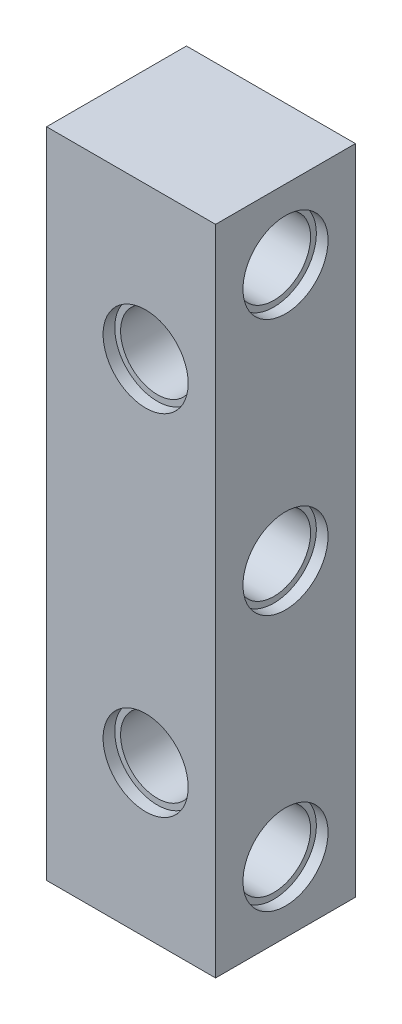
ISO-10303-21;
HEADER;
FILE_DESCRIPTION(('STEP AP214'),'2;1');
FILE_NAME('part.step','',(''),(''),'','','');
FILE_SCHEMA(('AUTOMOTIVE_DESIGN { 1 0 10303 214 1 1 1 1 }'));
ENDSEC;
DATA;
#1=APPLICATION_CONTEXT('core data for automotive mechanical design processes');
#2=APPLICATION_PROTOCOL_DEFINITION('international standard','automotive_design',2000,#1);
#3=PRODUCT_CONTEXT('',#1,'mechanical');
#4=PRODUCT('Part','Part','',(#3));
#5=PRODUCT_RELATED_PRODUCT_CATEGORY('part','',(#4));
#6=PRODUCT_DEFINITION_FORMATION('','',#4);
#7=PRODUCT_DEFINITION_CONTEXT('part definition',#1,'design');
#8=PRODUCT_DEFINITION('design','',#6,#7);
#9=PRODUCT_DEFINITION_SHAPE('','',#8);
#10=(LENGTH_UNIT() NAMED_UNIT(*) SI_UNIT(.MILLI.,.METRE.));
#11=(NAMED_UNIT(*) PLANE_ANGLE_UNIT() SI_UNIT($,.RADIAN.));
#12=(NAMED_UNIT(*) SI_UNIT($,.STERADIAN.) SOLID_ANGLE_UNIT());
#13=UNCERTAINTY_MEASURE_WITH_UNIT(LENGTH_MEASURE(1.E-05),#10,'distance_accuracy_value','');
#14=(GEOMETRIC_REPRESENTATION_CONTEXT(3) GLOBAL_UNCERTAINTY_ASSIGNED_CONTEXT((#13)) GLOBAL_UNIT_ASSIGNED_CONTEXT((#10,
#11,#12)) REPRESENTATION_CONTEXT('',''));
#15=CARTESIAN_POINT('',(0.,0.,0.));
#16=DIRECTION('',(0.,0.,1.));
#17=DIRECTION('',(1.,0.,0.));
#18=AXIS2_PLACEMENT_3D('',#15,#16,#17);
#19=CARTESIAN_POINT('',(0.,20.,6.));
#20=DIRECTION('',(1.,0.,0.));
#21=DIRECTION('',(0.,0.,-1.));
#22=AXIS2_PLACEMENT_3D('',#19,#20,#21);
#23=CYLINDRICAL_SURFACE('',#22,3.15);
#24=CARTESIAN_POINT('',(-2.5,20.,6.));
#25=DIRECTION('',(-1.,0.,0.));
#26=DIRECTION('',(0.,0.,1.));
#27=AXIS2_PLACEMENT_3D('',#24,#25,#26);
#28=CIRCLE('',#27,3.15);
#29=CARTESIAN_POINT('',(-2.5,20.,9.15));
#30=VERTEX_POINT('',#29);
#31=EDGE_CURVE('E144',#30,#30,#28,.F.);
#32=ORIENTED_EDGE('',*,*,#31,.F.);
#33=EDGE_LOOP('',(#32));
#34=FACE_BOUND('',#33,.T.);
#35=CARTESIAN_POINT('',(10.,20.,6.));
#36=DIRECTION('',(1.,0.,0.));
#37=DIRECTION('',(0.,0.,-1.));
#38=AXIS2_PLACEMENT_3D('',#35,#36,#37);
#39=CIRCLE('',#38,3.15);
#40=CARTESIAN_POINT('',(10.,20.,2.85));
#41=VERTEX_POINT('',#40);
#42=EDGE_CURVE('E39',#41,#41,#39,.F.);
#43=ORIENTED_EDGE('',*,*,#42,.F.);
#44=EDGE_LOOP('',(#43));
#45=FACE_BOUND('',#44,.T.);
#46=ADVANCED_FACE('F35',(#34,#45),#23,.F.);
#47=CARTESIAN_POINT('',(0.,42.,6.));
#48=DIRECTION('',(1.,0.,0.));
#49=DIRECTION('',(0.,0.,-1.));
#50=AXIS2_PLACEMENT_3D('',#47,#48,#49);
#51=CYLINDRICAL_SURFACE('',#50,3.15);
#52=CARTESIAN_POINT('',(-2.5,42.,6.));
#53=DIRECTION('',(-1.,0.,0.));
#54=DIRECTION('',(0.,0.,1.));
#55=AXIS2_PLACEMENT_3D('',#52,#53,#54);
#56=CIRCLE('',#55,3.15);
#57=CARTESIAN_POINT('',(-2.5,42.,9.15));
#58=VERTEX_POINT('',#57);
#59=EDGE_CURVE('E100',#58,#58,#56,.F.);
#60=ORIENTED_EDGE('',*,*,#59,.F.);
#61=EDGE_LOOP('',(#60));
#62=FACE_BOUND('',#61,.T.);
#63=CARTESIAN_POINT('',(10.,42.,6.));
#64=DIRECTION('',(1.,0.,0.));
#65=DIRECTION('',(0.,0.,-1.));
#66=AXIS2_PLACEMENT_3D('',#63,#64,#65);
#67=CIRCLE('',#66,3.15);
#68=CARTESIAN_POINT('',(10.,42.,2.85));
#69=VERTEX_POINT('',#68);
#70=EDGE_CURVE('E152',#69,#69,#67,.F.);
#71=ORIENTED_EDGE('',*,*,#70,.F.);
#72=EDGE_LOOP('',(#71));
#73=FACE_BOUND('',#72,.T.);
#74=ADVANCED_FACE('F210',(#62,#73),#51,.F.);
#75=CARTESIAN_POINT('',(0.,-1.99999999999999,6.));
#76=DIRECTION('',(1.,0.,0.));
#77=DIRECTION('',(0.,0.,-1.));
#78=AXIS2_PLACEMENT_3D('',#75,#76,#77);
#79=CYLINDRICAL_SURFACE('',#78,3.15);
#80=CARTESIAN_POINT('',(-2.5,-1.99999999999999,6.));
#81=DIRECTION('',(-1.,0.,0.));
#82=DIRECTION('',(0.,0.,1.));
#83=AXIS2_PLACEMENT_3D('',#80,#81,#82);
#84=CIRCLE('',#83,3.15);
#85=CARTESIAN_POINT('',(-2.5,-1.99999999999999,9.15));
#86=VERTEX_POINT('',#85);
#87=EDGE_CURVE('E141',#86,#86,#84,.F.);
#88=ORIENTED_EDGE('',*,*,#87,.F.);
#89=EDGE_LOOP('',(#88));
#90=FACE_BOUND('',#89,.T.);
#91=CARTESIAN_POINT('',(10.,-1.99999999999999,6.));
#92=DIRECTION('',(1.,0.,0.));
#93=DIRECTION('',(0.,0.,-1.));
#94=AXIS2_PLACEMENT_3D('',#91,#92,#93);
#95=CIRCLE('',#94,3.15);
#96=CARTESIAN_POINT('',(10.,-1.99999999999999,2.85));
#97=VERTEX_POINT('',#96);
#98=EDGE_CURVE('E148',#97,#97,#95,.F.);
#99=ORIENTED_EDGE('',*,*,#98,.F.);
#100=EDGE_LOOP('',(#99));
#101=FACE_BOUND('',#100,.T.);
#102=ADVANCED_FACE('F216',(#90,#101),#79,.F.);
#103=CARTESIAN_POINT('',(5.00000000000001,5.,0.));
#104=DIRECTION('',(0.,0.,1.));
#105=DIRECTION('',(1.,0.,0.));
#106=AXIS2_PLACEMENT_3D('',#103,#104,#105);
#107=CYLINDRICAL_SURFACE('',#106,3.15);
#108=CARTESIAN_POINT('',(5.00000000000001,5.,0.));
#109=DIRECTION('',(0.,0.,1.));
#110=DIRECTION('',(1.,0.,0.));
#111=AXIS2_PLACEMENT_3D('',#108,#109,#110);
#112=CIRCLE('',#111,3.15);
#113=CARTESIAN_POINT('',(8.15,5.,0.));
#114=VERTEX_POINT('',#113);
#115=EDGE_CURVE('E11',#114,#114,#112,.T.);
#116=ORIENTED_EDGE('',*,*,#115,.F.);
#117=EDGE_LOOP('',(#116));
#118=FACE_BOUND('',#117,.T.);
#119=CARTESIAN_POINT('',(5.00000000000001,5.,11.));
#120=DIRECTION('',(0.,0.,1.));
#121=DIRECTION('',(1.,0.,0.));
#122=AXIS2_PLACEMENT_3D('',#119,#120,#121);
#123=CIRCLE('',#122,3.15);
#124=CARTESIAN_POINT('',(8.15,5.,11.));
#125=VERTEX_POINT('',#124);
#126=EDGE_CURVE('E125',#125,#125,#123,.F.);
#127=ORIENTED_EDGE('',*,*,#126,.F.);
#128=EDGE_LOOP('',(#127));
#129=FACE_BOUND('',#128,.T.);
#130=ADVANCED_FACE('F229',(#118,#129),#107,.F.);
#131=CARTESIAN_POINT('',(5.,35.,0.));
#132=DIRECTION('',(0.,0.,1.));
#133=DIRECTION('',(1.,0.,0.));
#134=AXIS2_PLACEMENT_3D('',#131,#132,#133);
#135=CYLINDRICAL_SURFACE('',#134,3.15);
#136=CARTESIAN_POINT('',(5.,35.,0.));
#137=DIRECTION('',(0.,0.,1.));
#138=DIRECTION('',(1.,0.,0.));
#139=AXIS2_PLACEMENT_3D('',#136,#137,#138);
#140=CIRCLE('',#139,3.15);
#141=CARTESIAN_POINT('',(8.15,35.,0.));
#142=VERTEX_POINT('',#141);
#143=EDGE_CURVE('E44',#142,#142,#140,.T.);
#144=ORIENTED_EDGE('',*,*,#143,.F.);
#145=EDGE_LOOP('',(#144));
#146=FACE_BOUND('',#145,.T.);
#147=CARTESIAN_POINT('',(5.,35.,11.));
#148=DIRECTION('',(0.,0.,1.));
#149=DIRECTION('',(1.,0.,0.));
#150=AXIS2_PLACEMENT_3D('',#147,#148,#149);
#151=CIRCLE('',#150,3.15);
#152=CARTESIAN_POINT('',(8.15,35.,11.));
#153=VERTEX_POINT('',#152);
#154=EDGE_CURVE('E131',#153,#153,#151,.F.);
#155=ORIENTED_EDGE('',*,*,#154,.F.);
#156=EDGE_LOOP('',(#155));
#157=FACE_BOUND('',#156,.T.);
#158=ADVANCED_FACE('F225',(#146,#157),#135,.F.);
#159=CARTESIAN_POINT('',(0.,0.,12.));
#160=DIRECTION('',(0.,0.,-1.));
#161=DIRECTION('',(-1.,0.,0.));
#162=AXIS2_PLACEMENT_3D('',#159,#160,#161);
#163=PLANE('',#162);
#164=CARTESIAN_POINT('',(5.00000000000001,5.,12.));
#165=DIRECTION('',(0.,0.,1.));
#166=DIRECTION('',(1.,0.,0.));
#167=AXIS2_PLACEMENT_3D('',#164,#165,#166);
#168=CIRCLE('',#167,3.65);
#169=CARTESIAN_POINT('',(8.65000000000001,5.,12.));
#170=VERTEX_POINT('',#169);
#171=EDGE_CURVE('E119',#170,#170,#168,.T.);
#172=ORIENTED_EDGE('',*,*,#171,.F.);
#173=EDGE_LOOP('',(#172));
#174=FACE_BOUND('',#173,.T.);
#175=CARTESIAN_POINT('',(5.,35.,12.));
#176=DIRECTION('',(0.,0.,1.));
#177=DIRECTION('',(1.,0.,0.));
#178=AXIS2_PLACEMENT_3D('',#175,#176,#177);
#179=CIRCLE('',#178,3.65);
#180=CARTESIAN_POINT('',(8.65,35.,12.));
#181=VERTEX_POINT('',#180);
#182=EDGE_CURVE('E132',#181,#181,#179,.T.);
#183=ORIENTED_EDGE('',*,*,#182,.F.);
#184=EDGE_LOOP('',(#183));
#185=FACE_BOUND('',#184,.T.);
#186=DIRECTION('',(1.,0.,0.));
#187=VECTOR('',#186,1.);
#188=CARTESIAN_POINT('',(0.,-8.,12.));
#189=LINE('',#188,#187);
#190=CARTESIAN_POINT('',(-3.5,-8.,12.));
#191=VERTEX_POINT('',#190);
#192=CARTESIAN_POINT('',(11.,-8.,12.));
#193=VERTEX_POINT('',#192);
#194=EDGE_CURVE('E116',#191,#193,#189,.T.);
#195=ORIENTED_EDGE('',*,*,#194,.T.);
#196=DIRECTION('',(0.,-1.,0.));
#197=VECTOR('',#196,1.);
#198=CARTESIAN_POINT('',(11.,48.,12.));
#199=LINE('',#198,#197);
#200=CARTESIAN_POINT('',(11.,48.,12.));
#201=VERTEX_POINT('',#200);
#202=EDGE_CURVE('E112',#201,#193,#199,.T.);
#203=ORIENTED_EDGE('',*,*,#202,.F.);
#204=DIRECTION('',(1.,0.,0.));
#205=VECTOR('',#204,1.);
#206=CARTESIAN_POINT('',(0.,48.,12.));
#207=LINE('',#206,#205);
#208=CARTESIAN_POINT('',(-3.5,48.,12.));
#209=VERTEX_POINT('',#208);
#210=EDGE_CURVE('E84',#209,#201,#207,.T.);
#211=ORIENTED_EDGE('',*,*,#210,.F.);
#212=DIRECTION('',(0.,1.,0.));
#213=VECTOR('',#212,1.);
#214=CARTESIAN_POINT('',(-3.5,-8.,12.));
#215=LINE('',#214,#213);
#216=EDGE_CURVE('E99',#191,#209,#215,.T.);
#217=ORIENTED_EDGE('',*,*,#216,.F.);
#218=EDGE_LOOP('',(#195,#203,#211,#217));
#219=FACE_BOUND('',#218,.T.);
#220=ADVANCED_FACE('F228',(#174,#185,#219),#163,.F.);
#221=CARTESIAN_POINT('',(0.,0.,0.));
#222=DIRECTION('',(0.,0.,-1.));
#223=DIRECTION('',(-1.,0.,0.));
#224=AXIS2_PLACEMENT_3D('',#221,#222,#223);
#225=PLANE('',#224);
#226=DIRECTION('',(0.,-1.,0.));
#227=VECTOR('',#226,1.);
#228=CARTESIAN_POINT('',(11.,48.,0.));
#229=LINE('',#228,#227);
#230=CARTESIAN_POINT('',(11.,48.,0.));
#231=VERTEX_POINT('',#230);
#232=CARTESIAN_POINT('',(11.,-8.,0.));
#233=VERTEX_POINT('',#232);
#234=EDGE_CURVE('E52',#231,#233,#229,.T.);
#235=ORIENTED_EDGE('',*,*,#234,.T.);
#236=DIRECTION('',(1.,0.,0.));
#237=VECTOR('',#236,1.);
#238=CARTESIAN_POINT('',(0.,-8.,0.));
#239=LINE('',#238,#237);
#240=CARTESIAN_POINT('',(-3.5,-8.,0.));
#241=VERTEX_POINT('',#240);
#242=EDGE_CURVE('E90',#241,#233,#239,.T.);
#243=ORIENTED_EDGE('',*,*,#242,.F.);
#244=DIRECTION('',(0.,-1.,0.));
#245=VECTOR('',#244,1.);
#246=CARTESIAN_POINT('',(-3.5,48.,0.));
#247=LINE('',#246,#245);
#248=CARTESIAN_POINT('',(-3.5,48.,0.));
#249=VERTEX_POINT('',#248);
#250=EDGE_CURVE('E87',#249,#241,#247,.T.);
#251=ORIENTED_EDGE('',*,*,#250,.F.);
#252=DIRECTION('',(1.,0.,0.));
#253=VECTOR('',#252,1.);
#254=CARTESIAN_POINT('',(0.,48.,0.));
#255=LINE('',#254,#253);
#256=EDGE_CURVE('E76',#249,#231,#255,.T.);
#257=ORIENTED_EDGE('',*,*,#256,.T.);
#258=EDGE_LOOP('',(#235,#243,#251,#257));
#259=FACE_BOUND('',#258,.T.);
#260=ORIENTED_EDGE('',*,*,#143,.T.);
#261=EDGE_LOOP('',(#260));
#262=FACE_BOUND('',#261,.T.);
#263=ORIENTED_EDGE('',*,*,#115,.T.);
#264=EDGE_LOOP('',(#263));
#265=FACE_BOUND('',#264,.T.);
#266=ADVANCED_FACE('F37',(#259,#262,#265),#225,.T.);
#267=CARTESIAN_POINT('',(5.,35.,11.));
#268=DIRECTION('',(0.,0.,1.));
#269=DIRECTION('',(1.,0.,0.));
#270=AXIS2_PLACEMENT_3D('',#267,#268,#269);
#271=PLANE('',#270);
#272=CARTESIAN_POINT('',(5.,35.,11.));
#273=DIRECTION('',(0.,0.,1.));
#274=DIRECTION('',(1.,0.,0.));
#275=AXIS2_PLACEMENT_3D('',#272,#273,#274);
#276=CIRCLE('',#275,3.65);
#277=CARTESIAN_POINT('',(8.65,35.,11.));
#278=VERTEX_POINT('',#277);
#279=EDGE_CURVE('E128',#278,#278,#276,.T.);
#280=ORIENTED_EDGE('',*,*,#279,.T.);
#281=EDGE_LOOP('',(#280));
#282=FACE_BOUND('',#281,.T.);
#283=ORIENTED_EDGE('',*,*,#154,.T.);
#284=EDGE_LOOP('',(#283));
#285=FACE_BOUND('',#284,.T.);
#286=ADVANCED_FACE('F238',(#282,#285),#271,.T.);
#287=CARTESIAN_POINT('',(5.,35.,11.));
#288=DIRECTION('',(0.,0.,1.));
#289=DIRECTION('',(1.,0.,0.));
#290=AXIS2_PLACEMENT_3D('',#287,#288,#289);
#291=CYLINDRICAL_SURFACE('',#290,3.65);
#292=ORIENTED_EDGE('',*,*,#279,.F.);
#293=EDGE_LOOP('',(#292));
#294=FACE_BOUND('',#293,.T.);
#295=ORIENTED_EDGE('',*,*,#182,.T.);
#296=EDGE_LOOP('',(#295));
#297=FACE_BOUND('',#296,.T.);
#298=ADVANCED_FACE('F223',(#294,#297),#291,.F.);
#299=CARTESIAN_POINT('',(5.00000000000001,5.,11.));
#300=DIRECTION('',(0.,0.,1.));
#301=DIRECTION('',(1.,0.,0.));
#302=AXIS2_PLACEMENT_3D('',#299,#300,#301);
#303=PLANE('',#302);
#304=CARTESIAN_POINT('',(5.00000000000001,5.,11.));
#305=DIRECTION('',(0.,0.,1.));
#306=DIRECTION('',(1.,0.,0.));
#307=AXIS2_PLACEMENT_3D('',#304,#305,#306);
#308=CIRCLE('',#307,3.65);
#309=CARTESIAN_POINT('',(8.65000000000001,5.,11.));
#310=VERTEX_POINT('',#309);
#311=EDGE_CURVE('E122',#310,#310,#308,.T.);
#312=ORIENTED_EDGE('',*,*,#311,.T.);
#313=EDGE_LOOP('',(#312));
#314=FACE_BOUND('',#313,.T.);
#315=ORIENTED_EDGE('',*,*,#126,.T.);
#316=EDGE_LOOP('',(#315));
#317=FACE_BOUND('',#316,.T.);
#318=ADVANCED_FACE('F255',(#314,#317),#303,.T.);
#319=CARTESIAN_POINT('',(5.00000000000001,5.,11.));
#320=DIRECTION('',(0.,0.,1.));
#321=DIRECTION('',(1.,0.,0.));
#322=AXIS2_PLACEMENT_3D('',#319,#320,#321);
#323=CYLINDRICAL_SURFACE('',#322,3.65);
#324=ORIENTED_EDGE('',*,*,#311,.F.);
#325=EDGE_LOOP('',(#324));
#326=FACE_BOUND('',#325,.T.);
#327=ORIENTED_EDGE('',*,*,#171,.T.);
#328=EDGE_LOOP('',(#327));
#329=FACE_BOUND('',#328,.T.);
#330=ADVANCED_FACE('F251',(#326,#329),#323,.F.);
#331=CARTESIAN_POINT('',(11.,20.,6.));
#332=DIRECTION('',(1.,0.,0.));
#333=DIRECTION('',(0.,0.,-1.));
#334=AXIS2_PLACEMENT_3D('',#331,#332,#333);
#335=PLANE('',#334);
#336=CARTESIAN_POINT('',(11.,20.,6.));
#337=DIRECTION('',(1.,0.,0.));
#338=DIRECTION('',(0.,0.,-1.));
#339=AXIS2_PLACEMENT_3D('',#336,#337,#338);
#340=CIRCLE('',#339,3.65);
#341=CARTESIAN_POINT('',(11.,20.,2.35));
#342=VERTEX_POINT('',#341);
#343=EDGE_CURVE('E160',#342,#342,#340,.T.);
#344=ORIENTED_EDGE('',*,*,#343,.F.);
#345=EDGE_LOOP('',(#344));
#346=FACE_BOUND('',#345,.T.);
#347=CARTESIAN_POINT('',(11.,42.,6.));
#348=DIRECTION('',(1.,0.,0.));
#349=DIRECTION('',(0.,0.,-1.));
#350=AXIS2_PLACEMENT_3D('',#347,#348,#349);
#351=CIRCLE('',#350,3.65);
#352=CARTESIAN_POINT('',(11.,42.,2.35));
#353=VERTEX_POINT('',#352);
#354=EDGE_CURVE('E170',#353,#353,#351,.T.);
#355=ORIENTED_EDGE('',*,*,#354,.F.);
#356=EDGE_LOOP('',(#355));
#357=FACE_BOUND('',#356,.T.);
#358=CARTESIAN_POINT('',(11.,-1.99999999999999,6.));
#359=DIRECTION('',(1.,0.,0.));
#360=DIRECTION('',(0.,0.,-1.));
#361=AXIS2_PLACEMENT_3D('',#358,#359,#360);
#362=CIRCLE('',#361,3.65);
#363=CARTESIAN_POINT('',(11.,-1.99999999999999,2.35));
#364=VERTEX_POINT('',#363);
#365=EDGE_CURVE('E158',#364,#364,#362,.T.);
#366=ORIENTED_EDGE('',*,*,#365,.F.);
#367=EDGE_LOOP('',(#366));
#368=FACE_BOUND('',#367,.T.);
#369=DIRECTION('',(0.,0.,-1.));
#370=VECTOR('',#369,1.);
#371=CARTESIAN_POINT('',(11.,-8.,0.));
#372=LINE('',#371,#370);
#373=EDGE_CURVE('E57',#193,#233,#372,.T.);
#374=ORIENTED_EDGE('',*,*,#373,.T.);
#375=ORIENTED_EDGE('',*,*,#234,.F.);
#376=DIRECTION('',(0.,0.,-1.));
#377=VECTOR('',#376,1.);
#378=CARTESIAN_POINT('',(11.,48.,0.));
#379=LINE('',#378,#377);
#380=EDGE_CURVE('E82',#201,#231,#379,.T.);
#381=ORIENTED_EDGE('',*,*,#380,.F.);
#382=ORIENTED_EDGE('',*,*,#202,.T.);
#383=EDGE_LOOP('',(#374,#375,#381,#382));
#384=FACE_BOUND('',#383,.T.);
#385=ADVANCED_FACE('F246',(#346,#357,#368,#384),#335,.T.);
#386=CARTESIAN_POINT('',(0.,-8.,0.));
#387=DIRECTION('',(0.,-1.,0.));
#388=DIRECTION('',(0.,0.,-1.));
#389=AXIS2_PLACEMENT_3D('',#386,#387,#388);
#390=PLANE('',#389);
#391=ORIENTED_EDGE('',*,*,#373,.F.);
#392=ORIENTED_EDGE('',*,*,#194,.F.);
#393=DIRECTION('',(0.,0.,1.));
#394=VECTOR('',#393,1.);
#395=CARTESIAN_POINT('',(-3.5,-8.,0.));
#396=LINE('',#395,#394);
#397=EDGE_CURVE('E94',#241,#191,#396,.T.);
#398=ORIENTED_EDGE('',*,*,#397,.F.);
#399=ORIENTED_EDGE('',*,*,#242,.T.);
#400=EDGE_LOOP('',(#391,#392,#398,#399));
#401=FACE_BOUND('',#400,.T.);
#402=ADVANCED_FACE('F203',(#401),#390,.T.);
#403=CARTESIAN_POINT('',(0.,48.,0.));
#404=DIRECTION('',(0.,1.,0.));
#405=DIRECTION('',(0.,0.,1.));
#406=AXIS2_PLACEMENT_3D('',#403,#404,#405);
#407=PLANE('',#406);
#408=ORIENTED_EDGE('',*,*,#380,.T.);
#409=ORIENTED_EDGE('',*,*,#256,.F.);
#410=DIRECTION('',(0.,0.,-1.));
#411=VECTOR('',#410,1.);
#412=CARTESIAN_POINT('',(-3.5,48.,12.));
#413=LINE('',#412,#411);
#414=EDGE_CURVE('E81',#209,#249,#413,.T.);
#415=ORIENTED_EDGE('',*,*,#414,.F.);
#416=ORIENTED_EDGE('',*,*,#210,.T.);
#417=EDGE_LOOP('',(#408,#409,#415,#416));
#418=FACE_BOUND('',#417,.T.);
#419=ADVANCED_FACE('F78',(#418),#407,.T.);
#420=CARTESIAN_POINT('',(-3.5,0.,0.));
#421=DIRECTION('',(-1.,0.,0.));
#422=DIRECTION('',(0.,0.,1.));
#423=AXIS2_PLACEMENT_3D('',#420,#421,#422);
#424=PLANE('',#423);
#425=CARTESIAN_POINT('',(-3.5,20.,6.));
#426=DIRECTION('',(-1.,0.,0.));
#427=DIRECTION('',(0.,0.,1.));
#428=AXIS2_PLACEMENT_3D('',#425,#426,#427);
#429=CIRCLE('',#428,3.65);
#430=CARTESIAN_POINT('',(-3.5,20.,9.65));
#431=VERTEX_POINT('',#430);
#432=EDGE_CURVE('E179',#431,#431,#429,.T.);
#433=ORIENTED_EDGE('',*,*,#432,.F.);
#434=EDGE_LOOP('',(#433));
#435=FACE_BOUND('',#434,.T.);
#436=CARTESIAN_POINT('',(-3.5,-1.99999999999999,6.));
#437=DIRECTION('',(-1.,0.,0.));
#438=DIRECTION('',(0.,0.,1.));
#439=AXIS2_PLACEMENT_3D('',#436,#437,#438);
#440=CIRCLE('',#439,3.65);
#441=CARTESIAN_POINT('',(-3.5,-1.99999999999999,9.65));
#442=VERTEX_POINT('',#441);
#443=EDGE_CURVE('E150',#442,#442,#440,.T.);
#444=ORIENTED_EDGE('',*,*,#443,.F.);
#445=EDGE_LOOP('',(#444));
#446=FACE_BOUND('',#445,.T.);
#447=CARTESIAN_POINT('',(-3.5,42.,6.));
#448=DIRECTION('',(-1.,0.,0.));
#449=DIRECTION('',(0.,0.,1.));
#450=AXIS2_PLACEMENT_3D('',#447,#448,#449);
#451=CIRCLE('',#450,3.65);
#452=CARTESIAN_POINT('',(-3.5,42.,9.65));
#453=VERTEX_POINT('',#452);
#454=EDGE_CURVE('E106',#453,#453,#451,.T.);
#455=ORIENTED_EDGE('',*,*,#454,.F.);
#456=EDGE_LOOP('',(#455));
#457=FACE_BOUND('',#456,.T.);
#458=ORIENTED_EDGE('',*,*,#414,.T.);
#459=ORIENTED_EDGE('',*,*,#250,.T.);
#460=ORIENTED_EDGE('',*,*,#397,.T.);
#461=ORIENTED_EDGE('',*,*,#216,.T.);
#462=EDGE_LOOP('',(#458,#459,#460,#461));
#463=FACE_BOUND('',#462,.T.);
#464=ADVANCED_FACE('F97',(#435,#446,#457,#463),#424,.T.);
#465=CARTESIAN_POINT('',(-2.5,42.,6.));
#466=DIRECTION('',(-1.,0.,0.));
#467=DIRECTION('',(0.,0.,1.));
#468=AXIS2_PLACEMENT_3D('',#465,#466,#467);
#469=PLANE('',#468);
#470=CARTESIAN_POINT('',(-2.5,42.,6.));
#471=DIRECTION('',(-1.,0.,0.));
#472=DIRECTION('',(0.,0.,1.));
#473=AXIS2_PLACEMENT_3D('',#470,#471,#472);
#474=CIRCLE('',#473,3.65);
#475=CARTESIAN_POINT('',(-2.5,42.,9.65));
#476=VERTEX_POINT('',#475);
#477=EDGE_CURVE('E103',#476,#476,#474,.T.);
#478=ORIENTED_EDGE('',*,*,#477,.T.);
#479=EDGE_LOOP('',(#478));
#480=FACE_BOUND('',#479,.T.);
#481=ORIENTED_EDGE('',*,*,#59,.T.);
#482=EDGE_LOOP('',(#481));
#483=FACE_BOUND('',#482,.T.);
#484=ADVANCED_FACE('F195',(#480,#483),#469,.T.);
#485=CARTESIAN_POINT('',(-2.5,42.,6.));
#486=DIRECTION('',(-1.,0.,0.));
#487=DIRECTION('',(0.,0.,1.));
#488=AXIS2_PLACEMENT_3D('',#485,#486,#487);
#489=CYLINDRICAL_SURFACE('',#488,3.65);
#490=ORIENTED_EDGE('',*,*,#477,.F.);
#491=EDGE_LOOP('',(#490));
#492=FACE_BOUND('',#491,.T.);
#493=ORIENTED_EDGE('',*,*,#454,.T.);
#494=EDGE_LOOP('',(#493));
#495=FACE_BOUND('',#494,.T.);
#496=ADVANCED_FACE('F192',(#492,#495),#489,.F.);
#497=CARTESIAN_POINT('',(-2.5,-1.99999999999999,6.));
#498=DIRECTION('',(-1.,0.,0.));
#499=DIRECTION('',(0.,0.,1.));
#500=AXIS2_PLACEMENT_3D('',#497,#498,#499);
#501=PLANE('',#500);
#502=CARTESIAN_POINT('',(-2.5,-1.99999999999999,6.));
#503=DIRECTION('',(-1.,0.,0.));
#504=DIRECTION('',(0.,0.,1.));
#505=AXIS2_PLACEMENT_3D('',#502,#503,#504);
#506=CIRCLE('',#505,3.65);
#507=CARTESIAN_POINT('',(-2.5,-1.99999999999999,9.65));
#508=VERTEX_POINT('',#507);
#509=EDGE_CURVE('E182',#508,#508,#506,.T.);
#510=ORIENTED_EDGE('',*,*,#509,.T.);
#511=EDGE_LOOP('',(#510));
#512=FACE_BOUND('',#511,.T.);
#513=ORIENTED_EDGE('',*,*,#87,.T.);
#514=EDGE_LOOP('',(#513));
#515=FACE_BOUND('',#514,.T.);
#516=ADVANCED_FACE('F369',(#512,#515),#501,.T.);
#517=CARTESIAN_POINT('',(-2.5,-1.99999999999999,6.));
#518=DIRECTION('',(-1.,0.,0.));
#519=DIRECTION('',(0.,0.,1.));
#520=AXIS2_PLACEMENT_3D('',#517,#518,#519);
#521=CYLINDRICAL_SURFACE('',#520,3.65);
#522=ORIENTED_EDGE('',*,*,#509,.F.);
#523=EDGE_LOOP('',(#522));
#524=FACE_BOUND('',#523,.T.);
#525=ORIENTED_EDGE('',*,*,#443,.T.);
#526=EDGE_LOOP('',(#525));
#527=FACE_BOUND('',#526,.T.);
#528=ADVANCED_FACE('F365',(#524,#527),#521,.F.);
#529=CARTESIAN_POINT('',(-2.5,20.,6.));
#530=DIRECTION('',(-1.,0.,0.));
#531=DIRECTION('',(0.,0.,1.));
#532=AXIS2_PLACEMENT_3D('',#529,#530,#531);
#533=PLANE('',#532);
#534=CARTESIAN_POINT('',(-2.5,20.,6.));
#535=DIRECTION('',(-1.,0.,0.));
#536=DIRECTION('',(0.,0.,1.));
#537=AXIS2_PLACEMENT_3D('',#534,#535,#536);
#538=CIRCLE('',#537,3.65);
#539=CARTESIAN_POINT('',(-2.5,20.,9.65));
#540=VERTEX_POINT('',#539);
#541=EDGE_CURVE('E145',#540,#540,#538,.T.);
#542=ORIENTED_EDGE('',*,*,#541,.T.);
#543=EDGE_LOOP('',(#542));
#544=FACE_BOUND('',#543,.T.);
#545=ORIENTED_EDGE('',*,*,#31,.T.);
#546=EDGE_LOOP('',(#545));
#547=FACE_BOUND('',#546,.T.);
#548=ADVANCED_FACE('F362',(#544,#547),#533,.T.);
#549=CARTESIAN_POINT('',(-2.5,20.,6.));
#550=DIRECTION('',(-1.,0.,0.));
#551=DIRECTION('',(0.,0.,1.));
#552=AXIS2_PLACEMENT_3D('',#549,#550,#551);
#553=CYLINDRICAL_SURFACE('',#552,3.65);
#554=ORIENTED_EDGE('',*,*,#541,.F.);
#555=EDGE_LOOP('',(#554));
#556=FACE_BOUND('',#555,.T.);
#557=ORIENTED_EDGE('',*,*,#432,.T.);
#558=EDGE_LOOP('',(#557));
#559=FACE_BOUND('',#558,.T.);
#560=ADVANCED_FACE('F305',(#556,#559),#553,.F.);
#561=CARTESIAN_POINT('',(10.,-1.99999999999999,6.));
#562=DIRECTION('',(1.,0.,0.));
#563=DIRECTION('',(0.,0.,-1.));
#564=AXIS2_PLACEMENT_3D('',#561,#562,#563);
#565=PLANE('',#564);
#566=CARTESIAN_POINT('',(10.,-1.99999999999999,6.));
#567=DIRECTION('',(1.,0.,0.));
#568=DIRECTION('',(0.,0.,-1.));
#569=AXIS2_PLACEMENT_3D('',#566,#567,#568);
#570=CIRCLE('',#569,3.65);
#571=CARTESIAN_POINT('',(10.,-1.99999999999999,2.35));
#572=VERTEX_POINT('',#571);
#573=EDGE_CURVE('E151',#572,#572,#570,.T.);
#574=ORIENTED_EDGE('',*,*,#573,.T.);
#575=EDGE_LOOP('',(#574));
#576=FACE_BOUND('',#575,.T.);
#577=ORIENTED_EDGE('',*,*,#98,.T.);
#578=EDGE_LOOP('',(#577));
#579=FACE_BOUND('',#578,.T.);
#580=ADVANCED_FACE('F299',(#576,#579),#565,.T.);
#581=CARTESIAN_POINT('',(10.,-1.99999999999999,6.));
#582=DIRECTION('',(1.,0.,0.));
#583=DIRECTION('',(0.,0.,-1.));
#584=AXIS2_PLACEMENT_3D('',#581,#582,#583);
#585=CYLINDRICAL_SURFACE('',#584,3.65);
#586=ORIENTED_EDGE('',*,*,#573,.F.);
#587=EDGE_LOOP('',(#586));
#588=FACE_BOUND('',#587,.T.);
#589=ORIENTED_EDGE('',*,*,#365,.T.);
#590=EDGE_LOOP('',(#589));
#591=FACE_BOUND('',#590,.T.);
#592=ADVANCED_FACE('F304',(#588,#591),#585,.F.);
#593=CARTESIAN_POINT('',(10.,42.,6.));
#594=DIRECTION('',(1.,0.,0.));
#595=DIRECTION('',(0.,0.,-1.));
#596=AXIS2_PLACEMENT_3D('',#593,#594,#595);
#597=PLANE('',#596);
#598=CARTESIAN_POINT('',(10.,42.,6.));
#599=DIRECTION('',(1.,0.,0.));
#600=DIRECTION('',(0.,0.,-1.));
#601=AXIS2_PLACEMENT_3D('',#598,#599,#600);
#602=CIRCLE('',#601,3.65);
#603=CARTESIAN_POINT('',(10.,42.,2.35));
#604=VERTEX_POINT('',#603);
#605=EDGE_CURVE('E165',#604,#604,#602,.T.);
#606=ORIENTED_EDGE('',*,*,#605,.T.);
#607=EDGE_LOOP('',(#606));
#608=FACE_BOUND('',#607,.T.);
#609=ORIENTED_EDGE('',*,*,#70,.T.);
#610=EDGE_LOOP('',(#609));
#611=FACE_BOUND('',#610,.T.);
#612=ADVANCED_FACE('F317',(#608,#611),#597,.T.);
#613=CARTESIAN_POINT('',(10.,42.,6.));
#614=DIRECTION('',(1.,0.,0.));
#615=DIRECTION('',(0.,0.,-1.));
#616=AXIS2_PLACEMENT_3D('',#613,#614,#615);
#617=CYLINDRICAL_SURFACE('',#616,3.65);
#618=ORIENTED_EDGE('',*,*,#605,.F.);
#619=EDGE_LOOP('',(#618));
#620=FACE_BOUND('',#619,.T.);
#621=ORIENTED_EDGE('',*,*,#354,.T.);
#622=EDGE_LOOP('',(#621));
#623=FACE_BOUND('',#622,.T.);
#624=ADVANCED_FACE('F327',(#620,#623),#617,.F.);
#625=CARTESIAN_POINT('',(10.,20.,6.));
#626=DIRECTION('',(1.,0.,0.));
#627=DIRECTION('',(0.,0.,-1.));
#628=AXIS2_PLACEMENT_3D('',#625,#626,#627);
#629=PLANE('',#628);
#630=CARTESIAN_POINT('',(10.,20.,6.));
#631=DIRECTION('',(1.,0.,0.));
#632=DIRECTION('',(0.,0.,-1.));
#633=AXIS2_PLACEMENT_3D('',#630,#631,#632);
#634=CIRCLE('',#633,3.65);
#635=CARTESIAN_POINT('',(10.,20.,2.35));
#636=VERTEX_POINT('',#635);
#637=EDGE_CURVE('E154',#636,#636,#634,.T.);
#638=ORIENTED_EDGE('',*,*,#637,.T.);
#639=EDGE_LOOP('',(#638));
#640=FACE_BOUND('',#639,.T.);
#641=ORIENTED_EDGE('',*,*,#42,.T.);
#642=EDGE_LOOP('',(#641));
#643=FACE_BOUND('',#642,.T.);
#644=ADVANCED_FACE('F337',(#640,#643),#629,.T.);
#645=CARTESIAN_POINT('',(10.,20.,6.));
#646=DIRECTION('',(1.,0.,0.));
#647=DIRECTION('',(0.,0.,-1.));
#648=AXIS2_PLACEMENT_3D('',#645,#646,#647);
#649=CYLINDRICAL_SURFACE('',#648,3.65);
#650=ORIENTED_EDGE('',*,*,#637,.F.);
#651=EDGE_LOOP('',(#650));
#652=FACE_BOUND('',#651,.T.);
#653=ORIENTED_EDGE('',*,*,#343,.T.);
#654=EDGE_LOOP('',(#653));
#655=FACE_BOUND('',#654,.T.);
#656=ADVANCED_FACE('F347',(#652,#655),#649,.F.);
#657=CLOSED_SHELL('',(#46,#74,#102,#130,#158,#220,#266,#286,#298,#318,#330,#385,#402,#419,#464,
#484,#496,#516,#528,#548,#560,#580,#592,#612,#624,#644,#656));
#658=MANIFOLD_SOLID_BREP('B2',#657);
#659=ADVANCED_BREP_SHAPE_REPRESENTATION('',(#18,#658),#14);
#660=SHAPE_DEFINITION_REPRESENTATION(#9,#659);
ENDSEC;
END-ISO-10303-21;
